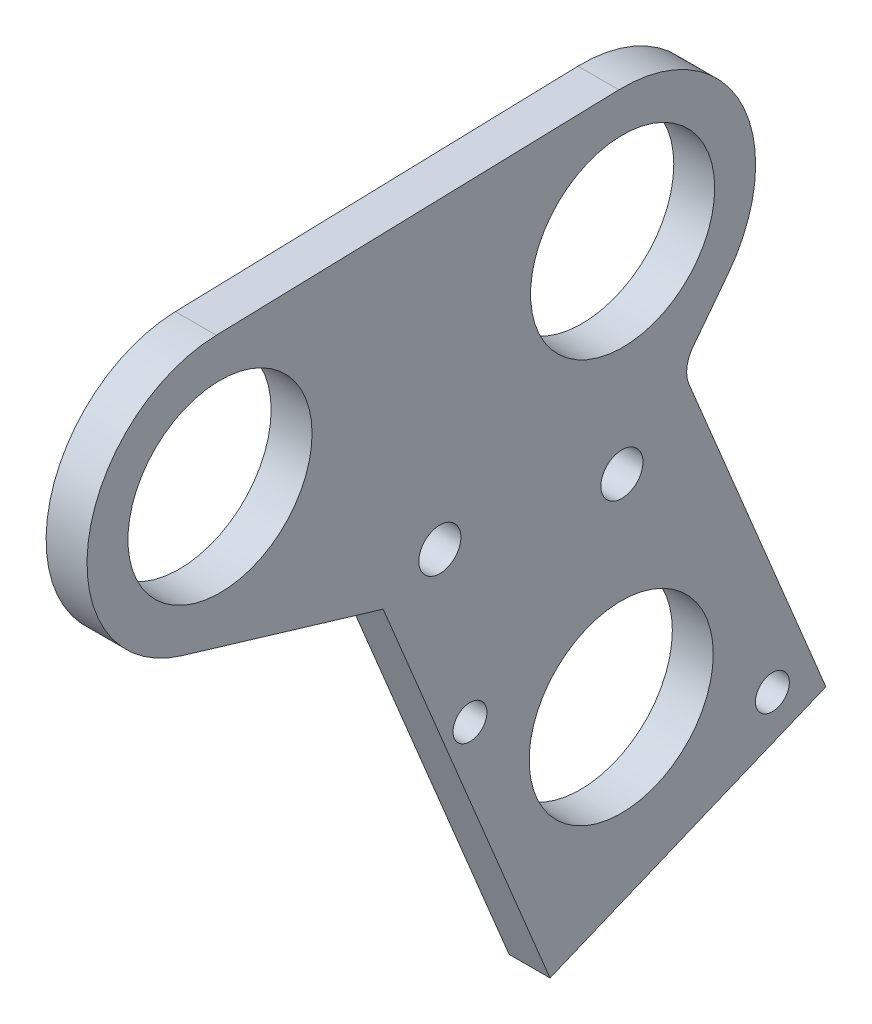
ISO-10303-21;
HEADER;
FILE_DESCRIPTION(('STEP AP214'),'2;1');
FILE_NAME('part.step','',(''),(''),'','','');
FILE_SCHEMA(('AUTOMOTIVE_DESIGN { 1 0 10303 214 1 1 1 1 }'));
ENDSEC;
DATA;
#1=APPLICATION_CONTEXT('core data for automotive mechanical design processes');
#2=APPLICATION_PROTOCOL_DEFINITION('international standard','automotive_design',2000,#1);
#3=PRODUCT_CONTEXT('',#1,'mechanical');
#4=PRODUCT('Part','Part','',(#3));
#5=PRODUCT_RELATED_PRODUCT_CATEGORY('part','',(#4));
#6=PRODUCT_DEFINITION_FORMATION('','',#4);
#7=PRODUCT_DEFINITION_CONTEXT('part definition',#1,'design');
#8=PRODUCT_DEFINITION('design','',#6,#7);
#9=PRODUCT_DEFINITION_SHAPE('','',#8);
#10=(LENGTH_UNIT() NAMED_UNIT(*) SI_UNIT(.MILLI.,.METRE.));
#11=(NAMED_UNIT(*) PLANE_ANGLE_UNIT() SI_UNIT($,.RADIAN.));
#12=(NAMED_UNIT(*) SI_UNIT($,.STERADIAN.) SOLID_ANGLE_UNIT());
#13=UNCERTAINTY_MEASURE_WITH_UNIT(LENGTH_MEASURE(1.E-05),#10,'distance_accuracy_value','');
#14=(GEOMETRIC_REPRESENTATION_CONTEXT(3) GLOBAL_UNCERTAINTY_ASSIGNED_CONTEXT((#13)) GLOBAL_UNIT_ASSIGNED_CONTEXT((#10,
#11,#12)) REPRESENTATION_CONTEXT('',''));
#15=CARTESIAN_POINT('',(0.,0.,0.));
#16=DIRECTION('',(0.,0.,1.));
#17=DIRECTION('',(1.,0.,0.));
#18=AXIS2_PLACEMENT_3D('',#15,#16,#17);
#19=CARTESIAN_POINT('',(6.35,178.280870815716,-272.869505506602));
#20=DIRECTION('',(1.,0.,0.));
#21=DIRECTION('',(0.,0.,-1.));
#22=AXIS2_PLACEMENT_3D('',#19,#20,#21);
#23=PLANE('',#22);
#24=CARTESIAN_POINT('',(6.35,151.048406008228,-244.504033835122));
#25=DIRECTION('',(1.,0.,0.));
#26=DIRECTION('',(0.,0.,-1.));
#27=AXIS2_PLACEMENT_3D('',#24,#25,#26);
#28=CIRCLE('',#27,3.26390000000001);
#29=CARTESIAN_POINT('',(6.35,151.048406008228,-247.767933835122));
#30=VERTEX_POINT('',#29);
#31=EDGE_CURVE('E271',#30,#30,#28,.T.);
#32=ORIENTED_EDGE('',*,*,#31,.F.);
#33=EDGE_LOOP('',(#32));
#34=FACE_BOUND('',#33,.T.);
#35=CARTESIAN_POINT('',(6.35,176.533582155287,-210.384530747088));
#36=DIRECTION('',(1.,0.,0.));
#37=DIRECTION('',(0.,0.,-1.));
#38=AXIS2_PLACEMENT_3D('',#35,#36,#37);
#39=CIRCLE('',#38,14.2875);
#40=CARTESIAN_POINT('',(6.35,176.533582155287,-224.672030747088));
#41=VERTEX_POINT('',#40);
#42=EDGE_CURVE('E255',#41,#41,#39,.T.);
#43=ORIENTED_EDGE('',*,*,#42,.F.);
#44=EDGE_LOOP('',(#43));
#45=FACE_BOUND('',#44,.T.);
#46=CARTESIAN_POINT('',(6.35,125.492031649383,-249.178886841428));
#47=DIRECTION('',(1.,0.,0.));
#48=DIRECTION('',(0.,0.,-1.));
#49=AXIS2_PLACEMENT_3D('',#46,#47,#48);
#50=CIRCLE('',#49,2.62890000000002);
#51=CARTESIAN_POINT('',(6.35,125.492031649383,-251.807786841428));
#52=VERTEX_POINT('',#51);
#53=EDGE_CURVE('E239',#52,#52,#50,.T.);
#54=ORIENTED_EDGE('',*,*,#53,.F.);
#55=EDGE_LOOP('',(#54));
#56=FACE_BOUND('',#55,.T.);
#57=DIRECTION('',(0.,0.923879533240872,0.382683430603715));
#58=VECTOR('',#57,1.);
#59=CARTESIAN_POINT('',(6.35,102.615117991688,-304.408641761252));
#60=LINE('',#59,#58);
#61=CARTESIAN_POINT('',(6.35,102.615117991688,-304.408641761252));
#62=VERTEX_POINT('',#61);
#63=CARTESIAN_POINT('',(6.35,153.891404032131,-283.169308769709));
#64=VERTEX_POINT('',#63);
#65=EDGE_CURVE('E121',#62,#64,#60,.T.);
#66=ORIENTED_EDGE('',*,*,#65,.T.);
#67=CARTESIAN_POINT('',(6.35,155.713933870382,-287.569285046769));
#68=DIRECTION('',(1.,0.,0.));
#69=DIRECTION('',(0.,0.,-1.));
#70=AXIS2_PLACEMENT_3D('',#67,#68,#69);
#71=CIRCLE('',#70,4.7625);
#72=CARTESIAN_POINT('',(6.35,158.613160183239,-283.790939769159));
#73=VERTEX_POINT('',#72);
#74=EDGE_CURVE('E11',#64,#73,#71,.F.);
#75=ORIENTED_EDGE('',*,*,#74,.T.);
#76=DIRECTION('',(0.,0.793353339130631,-0.608761430521249));
#77=VECTOR('',#76,1.);
#78=CARTESIAN_POINT('',(6.35,156.43173152012,-282.117070676989));
#79=LINE('',#78,#77);
#80=CARTESIAN_POINT('',(6.35,165.717556793334,-289.242335042911));
#81=VERTEX_POINT('',#80);
#82=EDGE_CURVE('E110',#73,#81,#79,.T.);
#83=ORIENTED_EDGE('',*,*,#82,.T.);
#84=CARTESIAN_POINT('',(6.35,178.280870815716,-272.869505506602));
#85=DIRECTION('',(1.,0.,0.));
#86=DIRECTION('',(0.,0.,-1.));
#87=AXIS2_PLACEMENT_3D('',#84,#85,#86);
#88=CIRCLE('',#87,20.6375);
#89=CARTESIAN_POINT('',(6.35,198.910306814134,-272.292637551869));
#90=VERTEX_POINT('',#89);
#91=EDGE_CURVE('E114',#81,#90,#88,.T.);
#92=ORIENTED_EDGE('',*,*,#91,.T.);
#93=DIRECTION('',(0.,-0.0279524145237204,0.999609254920288));
#94=VECTOR('',#93,1.);
#95=CARTESIAN_POINT('',(6.35,198.057364051982,-241.790461139146));
#96=LINE('',#95,#94);
#97=CARTESIAN_POINT('',(6.35,197.163018153705,-209.807662792355));
#98=VERTEX_POINT('',#97);
#99=EDGE_CURVE('E138',#90,#98,#96,.T.);
#100=ORIENTED_EDGE('',*,*,#99,.T.);
#101=CARTESIAN_POINT('',(6.35,176.533582155287,-210.384530747088));
#102=DIRECTION('',(1.,0.,0.));
#103=DIRECTION('',(0.,0.,-1.));
#104=AXIS2_PLACEMENT_3D('',#101,#102,#103);
#105=CIRCLE('',#104,20.6375);
#106=CARTESIAN_POINT('',(6.35,156.764386520821,-204.461245322917));
#107=VERTEX_POINT('',#106);
#108=EDGE_CURVE('E141',#98,#107,#105,.T.);
#109=ORIENTED_EDGE('',*,*,#108,.T.);
#110=DIRECTION('',(0.,-0.287015647446186,-0.957925893856642));
#111=VECTOR('',#110,1.);
#112=CARTESIAN_POINT('',(6.35,156.764386520821,-204.461245322917));
#113=LINE('',#112,#111);
#114=CARTESIAN_POINT('',(6.35,147.403346331728,-235.704081281002));
#115=VERTEX_POINT('',#114);
#116=EDGE_CURVE('E147',#107,#115,#113,.T.);
#117=ORIENTED_EDGE('',*,*,#116,.T.);
#118=DIRECTION('',(0.,-0.923879533240872,-0.382683430603714));
#119=VECTOR('',#118,1.);
#120=CARTESIAN_POINT('',(6.35,84.8834718986503,-261.600661049402));
#121=LINE('',#120,#119);
#122=CARTESIAN_POINT('',(6.35,84.8834718986503,-261.600661049402));
#123=VERTEX_POINT('',#122);
#124=EDGE_CURVE('E150',#115,#123,#121,.T.);
#125=ORIENTED_EDGE('',*,*,#124,.T.);
#126=DIRECTION('',(0.,0.382683430603714,-0.923879533240872));
#127=VECTOR('',#126,1.);
#128=CARTESIAN_POINT('',(6.35,84.8834718986503,-261.600661049402));
#129=LINE('',#128,#127);
#130=EDGE_CURVE('E153',#123,#62,#129,.T.);
#131=ORIENTED_EDGE('',*,*,#130,.T.);
#132=EDGE_LOOP('',(#66,#75,#83,#92,#100,#109,#117,#125,#131));
#133=FACE_BOUND('',#132,.T.);
#134=CARTESIAN_POINT('',(6.35,106.051713243434,-296.111966940839));
#135=DIRECTION('',(1.,0.,0.));
#136=DIRECTION('',(0.,0.,-1.));
#137=AXIS2_PLACEMENT_3D('',#134,#135,#136);
#138=CIRCLE('',#137,2.62889999999999);
#139=CARTESIAN_POINT('',(6.35,106.051713243434,-298.740866940839));
#140=VERTEX_POINT('',#139);
#141=EDGE_CURVE('E160',#140,#140,#138,.T.);
#142=ORIENTED_EDGE('',*,*,#141,.F.);
#143=EDGE_LOOP('',(#142));
#144=FACE_BOUND('',#143,.T.);
#145=CARTESIAN_POINT('',(6.35,115.771872446409,-272.645426891133));
#146=DIRECTION('',(1.,0.,0.));
#147=DIRECTION('',(0.,0.,-1.));
#148=AXIS2_PLACEMENT_3D('',#145,#146,#147);
#149=CIRCLE('',#148,14.2875);
#150=CARTESIAN_POINT('',(6.35,115.771872446409,-286.932926891133));
#151=VERTEX_POINT('',#150);
#152=EDGE_CURVE('E247',#151,#151,#149,.T.);
#153=ORIENTED_EDGE('',*,*,#152,.F.);
#154=EDGE_LOOP('',(#153));
#155=FACE_BOUND('',#154,.T.);
#156=CARTESIAN_POINT('',(6.35,178.280870815716,-272.869505506602));
#157=DIRECTION('',(1.,0.,0.));
#158=DIRECTION('',(0.,0.,-1.));
#159=AXIS2_PLACEMENT_3D('',#156,#157,#158);
#160=CIRCLE('',#159,14.2875);
#161=CARTESIAN_POINT('',(6.35,178.280870815716,-287.157005506602));
#162=VERTEX_POINT('',#161);
#163=EDGE_CURVE('E263',#162,#162,#160,.T.);
#164=ORIENTED_EDGE('',*,*,#163,.F.);
#165=EDGE_LOOP('',(#164));
#166=FACE_BOUND('',#165,.T.);
#167=CARTESIAN_POINT('',(6.35,147.026371631063,-272.757466198868));
#168=DIRECTION('',(1.,0.,0.));
#169=DIRECTION('',(0.,0.,-1.));
#170=AXIS2_PLACEMENT_3D('',#167,#168,#169);
#171=CIRCLE('',#170,3.26390000000001);
#172=CARTESIAN_POINT('',(6.35,147.026371631063,-276.021366198868));
#173=VERTEX_POINT('',#172);
#174=EDGE_CURVE('E279',#173,#173,#171,.T.);
#175=ORIENTED_EDGE('',*,*,#174,.F.);
#176=EDGE_LOOP('',(#175));
#177=FACE_BOUND('',#176,.T.);
#178=ADVANCED_FACE('F39',(#34,#45,#56,#133,#144,#155,#166,#177),#23,.T.);
#179=CARTESIAN_POINT('',(0.,178.280870815716,-272.869505506602));
#180=DIRECTION('',(1.,0.,0.));
#181=DIRECTION('',(0.,0.,-1.));
#182=AXIS2_PLACEMENT_3D('',#179,#180,#181);
#183=PLANE('',#182);
#184=DIRECTION('',(0.,0.923879533240872,0.382683430603715));
#185=VECTOR('',#184,1.);
#186=CARTESIAN_POINT('',(0.,102.615117991688,-304.408641761252));
#187=LINE('',#186,#185);
#188=CARTESIAN_POINT('',(0.,102.615117991688,-304.408641761252));
#189=VERTEX_POINT('',#188);
#190=CARTESIAN_POINT('',(0.,153.891404032131,-283.169308769709));
#191=VERTEX_POINT('',#190);
#192=EDGE_CURVE('E157',#189,#191,#187,.T.);
#193=ORIENTED_EDGE('',*,*,#192,.F.);
#194=DIRECTION('',(0.,0.382683430603714,-0.923879533240872));
#195=VECTOR('',#194,1.);
#196=CARTESIAN_POINT('',(0.,84.8834718986503,-261.600661049402));
#197=LINE('',#196,#195);
#198=CARTESIAN_POINT('',(0.,84.8834718986503,-261.600661049402));
#199=VERTEX_POINT('',#198);
#200=EDGE_CURVE('E178',#199,#189,#197,.T.);
#201=ORIENTED_EDGE('',*,*,#200,.F.);
#202=DIRECTION('',(0.,-0.923879533240872,-0.382683430603714));
#203=VECTOR('',#202,1.);
#204=CARTESIAN_POINT('',(0.,84.8834718986503,-261.600661049402));
#205=LINE('',#204,#203);
#206=CARTESIAN_POINT('',(0.,147.403346331728,-235.704081281002));
#207=VERTEX_POINT('',#206);
#208=EDGE_CURVE('E175',#207,#199,#205,.T.);
#209=ORIENTED_EDGE('',*,*,#208,.F.);
#210=DIRECTION('',(0.,-0.287015647446186,-0.957925893856642));
#211=VECTOR('',#210,1.);
#212=CARTESIAN_POINT('',(0.,156.764386520821,-204.461245322917));
#213=LINE('',#212,#211);
#214=CARTESIAN_POINT('',(0.,156.764386520821,-204.461245322917));
#215=VERTEX_POINT('',#214);
#216=EDGE_CURVE('E172',#215,#207,#213,.T.);
#217=ORIENTED_EDGE('',*,*,#216,.F.);
#218=CARTESIAN_POINT('',(0.,176.533582155287,-210.384530747088));
#219=DIRECTION('',(1.,0.,0.));
#220=DIRECTION('',(0.,0.,-1.));
#221=AXIS2_PLACEMENT_3D('',#218,#219,#220);
#222=CIRCLE('',#221,20.6375);
#223=CARTESIAN_POINT('',(0.,197.163018153705,-209.807662792355));
#224=VERTEX_POINT('',#223);
#225=EDGE_CURVE('E169',#224,#215,#222,.T.);
#226=ORIENTED_EDGE('',*,*,#225,.F.);
#227=DIRECTION('',(0.,-0.0279524145237189,0.999609254920288));
#228=VECTOR('',#227,1.);
#229=CARTESIAN_POINT('',(0.,198.057364051982,-241.790461139146));
#230=LINE('',#229,#228);
#231=CARTESIAN_POINT('',(0.,198.910306814134,-272.292637551869));
#232=VERTEX_POINT('',#231);
#233=EDGE_CURVE('E166',#232,#224,#230,.T.);
#234=ORIENTED_EDGE('',*,*,#233,.F.);
#235=CARTESIAN_POINT('',(0.,178.280870815716,-272.869505506602));
#236=DIRECTION('',(1.,0.,0.));
#237=DIRECTION('',(0.,0.,-1.));
#238=AXIS2_PLACEMENT_3D('',#235,#236,#237);
#239=CIRCLE('',#238,20.6375);
#240=CARTESIAN_POINT('',(0.,165.717556793334,-289.242335042911));
#241=VERTEX_POINT('',#240);
#242=EDGE_CURVE('E163',#241,#232,#239,.T.);
#243=ORIENTED_EDGE('',*,*,#242,.F.);
#244=DIRECTION('',(0.,0.793353339130631,-0.608761430521249));
#245=VECTOR('',#244,1.);
#246=CARTESIAN_POINT('',(0.,156.43173152012,-282.117070676989));
#247=LINE('',#246,#245);
#248=CARTESIAN_POINT('',(0.,158.613160183239,-283.790939769159));
#249=VERTEX_POINT('',#248);
#250=EDGE_CURVE('E126',#249,#241,#247,.T.);
#251=ORIENTED_EDGE('',*,*,#250,.F.);
#252=CARTESIAN_POINT('',(0.,155.713933870382,-287.569285046769));
#253=DIRECTION('',(1.,0.,0.));
#254=DIRECTION('',(0.,0.,-1.));
#255=AXIS2_PLACEMENT_3D('',#252,#253,#254);
#256=CIRCLE('',#255,4.7625);
#257=EDGE_CURVE('E48',#249,#191,#256,.T.);
#258=ORIENTED_EDGE('',*,*,#257,.T.);
#259=EDGE_LOOP('',(#193,#201,#209,#217,#226,#234,#243,#251,#258));
#260=FACE_BOUND('',#259,.T.);
#261=CARTESIAN_POINT('',(0.,106.051713243434,-296.111966940839));
#262=DIRECTION('',(1.,0.,0.));
#263=DIRECTION('',(0.,0.,-1.));
#264=AXIS2_PLACEMENT_3D('',#261,#262,#263);
#265=CIRCLE('',#264,2.62889999999999);
#266=CARTESIAN_POINT('',(0.,106.051713243434,-298.740866940839));
#267=VERTEX_POINT('',#266);
#268=EDGE_CURVE('E235',#267,#267,#265,.T.);
#269=ORIENTED_EDGE('',*,*,#268,.T.);
#270=EDGE_LOOP('',(#269));
#271=FACE_BOUND('',#270,.T.);
#272=CARTESIAN_POINT('',(0.,125.492031649383,-249.178886841428));
#273=DIRECTION('',(1.,0.,0.));
#274=DIRECTION('',(0.,0.,-1.));
#275=AXIS2_PLACEMENT_3D('',#272,#273,#274);
#276=CIRCLE('',#275,2.62890000000002);
#277=CARTESIAN_POINT('',(0.,125.492031649383,-251.807786841428));
#278=VERTEX_POINT('',#277);
#279=EDGE_CURVE('E243',#278,#278,#276,.T.);
#280=ORIENTED_EDGE('',*,*,#279,.T.);
#281=EDGE_LOOP('',(#280));
#282=FACE_BOUND('',#281,.T.);
#283=CARTESIAN_POINT('',(0.,115.771872446409,-272.645426891133));
#284=DIRECTION('',(1.,0.,0.));
#285=DIRECTION('',(0.,0.,-1.));
#286=AXIS2_PLACEMENT_3D('',#283,#284,#285);
#287=CIRCLE('',#286,14.2875);
#288=CARTESIAN_POINT('',(0.,115.771872446409,-286.932926891133));
#289=VERTEX_POINT('',#288);
#290=EDGE_CURVE('E251',#289,#289,#287,.T.);
#291=ORIENTED_EDGE('',*,*,#290,.T.);
#292=EDGE_LOOP('',(#291));
#293=FACE_BOUND('',#292,.T.);
#294=CARTESIAN_POINT('',(0.,176.533582155287,-210.384530747088));
#295=DIRECTION('',(1.,0.,0.));
#296=DIRECTION('',(0.,0.,-1.));
#297=AXIS2_PLACEMENT_3D('',#294,#295,#296);
#298=CIRCLE('',#297,14.2875);
#299=CARTESIAN_POINT('',(0.,176.533582155287,-224.672030747088));
#300=VERTEX_POINT('',#299);
#301=EDGE_CURVE('E259',#300,#300,#298,.T.);
#302=ORIENTED_EDGE('',*,*,#301,.T.);
#303=EDGE_LOOP('',(#302));
#304=FACE_BOUND('',#303,.T.);
#305=CARTESIAN_POINT('',(0.,178.280870815716,-272.869505506602));
#306=DIRECTION('',(1.,0.,0.));
#307=DIRECTION('',(0.,0.,-1.));
#308=AXIS2_PLACEMENT_3D('',#305,#306,#307);
#309=CIRCLE('',#308,14.2875);
#310=CARTESIAN_POINT('',(0.,178.280870815716,-287.157005506602));
#311=VERTEX_POINT('',#310);
#312=EDGE_CURVE('E267',#311,#311,#309,.T.);
#313=ORIENTED_EDGE('',*,*,#312,.T.);
#314=EDGE_LOOP('',(#313));
#315=FACE_BOUND('',#314,.T.);
#316=CARTESIAN_POINT('',(0.,151.048406008228,-244.504033835122));
#317=DIRECTION('',(1.,0.,0.));
#318=DIRECTION('',(0.,0.,-1.));
#319=AXIS2_PLACEMENT_3D('',#316,#317,#318);
#320=CIRCLE('',#319,3.26390000000001);
#321=CARTESIAN_POINT('',(0.,151.048406008228,-247.767933835122));
#322=VERTEX_POINT('',#321);
#323=EDGE_CURVE('E275',#322,#322,#320,.T.);
#324=ORIENTED_EDGE('',*,*,#323,.T.);
#325=EDGE_LOOP('',(#324));
#326=FACE_BOUND('',#325,.T.);
#327=CARTESIAN_POINT('',(0.,147.026371631063,-272.757466198868));
#328=DIRECTION('',(1.,0.,0.));
#329=DIRECTION('',(0.,0.,-1.));
#330=AXIS2_PLACEMENT_3D('',#327,#328,#329);
#331=CIRCLE('',#330,3.26390000000001);
#332=CARTESIAN_POINT('',(0.,147.026371631063,-276.021366198868));
#333=VERTEX_POINT('',#332);
#334=EDGE_CURVE('E283',#333,#333,#331,.T.);
#335=ORIENTED_EDGE('',*,*,#334,.T.);
#336=EDGE_LOOP('',(#335));
#337=FACE_BOUND('',#336,.T.);
#338=ADVANCED_FACE('F207',(#260,#271,#282,#293,#304,#315,#326,#337),#183,.F.);
#339=CARTESIAN_POINT('',(6.35,102.615117991688,-304.408641761252));
#340=DIRECTION('',(0.,-0.382683430603715,0.923879533240872));
#341=DIRECTION('',(0.,-0.923879533240872,-0.382683430603715));
#342=AXIS2_PLACEMENT_3D('',#339,#340,#341);
#343=PLANE('',#342);
#344=ORIENTED_EDGE('',*,*,#192,.T.);
#345=DIRECTION('',(-1.,0.,0.));
#346=VECTOR('',#345,1.);
#347=CARTESIAN_POINT('',(6.35,153.891404032131,-283.169308769709));
#348=LINE('',#347,#346);
#349=EDGE_CURVE('E55',#191,#64,#348,.F.);
#350=ORIENTED_EDGE('',*,*,#349,.T.);
#351=ORIENTED_EDGE('',*,*,#65,.F.);
#352=DIRECTION('',(-1.,0.,0.));
#353=VECTOR('',#352,1.);
#354=CARTESIAN_POINT('',(6.35,102.615117991688,-304.408641761252));
#355=LINE('',#354,#353);
#356=EDGE_CURVE('E156',#62,#189,#355,.T.);
#357=ORIENTED_EDGE('',*,*,#356,.T.);
#358=EDGE_LOOP('',(#344,#350,#351,#357));
#359=FACE_BOUND('',#358,.T.);
#360=ADVANCED_FACE('F232',(#359),#343,.F.);
#361=CARTESIAN_POINT('',(6.35,156.43173152012,-282.117070676989));
#362=DIRECTION('',(0.,0.608761430521249,0.793353339130631));
#363=DIRECTION('',(0.,-0.793353339130631,0.608761430521249));
#364=AXIS2_PLACEMENT_3D('',#361,#362,#363);
#365=PLANE('',#364);
#366=ORIENTED_EDGE('',*,*,#82,.F.);
#367=DIRECTION('',(-1.,0.,0.));
#368=VECTOR('',#367,1.);
#369=CARTESIAN_POINT('',(0.,158.613160183239,-283.790939769159));
#370=LINE('',#369,#368);
#371=EDGE_CURVE('E131',#73,#249,#370,.T.);
#372=ORIENTED_EDGE('',*,*,#371,.T.);
#373=ORIENTED_EDGE('',*,*,#250,.T.);
#374=DIRECTION('',(-1.,0.,0.));
#375=VECTOR('',#374,1.);
#376=CARTESIAN_POINT('',(6.35,165.717556793334,-289.242335042911));
#377=LINE('',#376,#375);
#378=EDGE_CURVE('E124',#81,#241,#377,.T.);
#379=ORIENTED_EDGE('',*,*,#378,.F.);
#380=EDGE_LOOP('',(#366,#372,#373,#379));
#381=FACE_BOUND('',#380,.T.);
#382=ADVANCED_FACE('F125',(#381),#365,.F.);
#383=CARTESIAN_POINT('',(6.35,178.280870815716,-272.869505506602));
#384=DIRECTION('',(-1.,0.,0.));
#385=DIRECTION('',(0.,0.,1.));
#386=AXIS2_PLACEMENT_3D('',#383,#384,#385);
#387=CYLINDRICAL_SURFACE('',#386,20.6375);
#388=ORIENTED_EDGE('',*,*,#242,.T.);
#389=DIRECTION('',(-1.,0.,0.));
#390=VECTOR('',#389,1.);
#391=CARTESIAN_POINT('',(6.35,198.910306814134,-272.292637551869));
#392=LINE('',#391,#390);
#393=EDGE_CURVE('E132',#90,#232,#392,.T.);
#394=ORIENTED_EDGE('',*,*,#393,.F.);
#395=ORIENTED_EDGE('',*,*,#91,.F.);
#396=ORIENTED_EDGE('',*,*,#378,.T.);
#397=EDGE_LOOP('',(#388,#394,#395,#396));
#398=FACE_BOUND('',#397,.T.);
#399=ADVANCED_FACE('F134',(#398),#387,.T.);
#400=CARTESIAN_POINT('',(6.35,198.057364051982,-241.790461139146));
#401=DIRECTION('',(0.,-0.999609254920288,-0.0279524145237189));
#402=DIRECTION('',(0.,0.0279524145237189,-0.999609254920289));
#403=AXIS2_PLACEMENT_3D('',#400,#401,#402);
#404=PLANE('',#403);
#405=ORIENTED_EDGE('',*,*,#233,.T.);
#406=DIRECTION('',(-1.,0.,0.));
#407=VECTOR('',#406,1.);
#408=CARTESIAN_POINT('',(6.35,197.163018153705,-209.807662792355));
#409=LINE('',#408,#407);
#410=EDGE_CURVE('E196',#98,#224,#409,.T.);
#411=ORIENTED_EDGE('',*,*,#410,.F.);
#412=ORIENTED_EDGE('',*,*,#99,.F.);
#413=ORIENTED_EDGE('',*,*,#393,.T.);
#414=EDGE_LOOP('',(#405,#411,#412,#413));
#415=FACE_BOUND('',#414,.T.);
#416=ADVANCED_FACE('F211',(#415),#404,.F.);
#417=CARTESIAN_POINT('',(6.35,176.533582155287,-210.384530747088));
#418=DIRECTION('',(-1.,0.,0.));
#419=DIRECTION('',(0.,0.,1.));
#420=AXIS2_PLACEMENT_3D('',#417,#418,#419);
#421=CYLINDRICAL_SURFACE('',#420,20.6375);
#422=ORIENTED_EDGE('',*,*,#225,.T.);
#423=DIRECTION('',(-1.,0.,0.));
#424=VECTOR('',#423,1.);
#425=CARTESIAN_POINT('',(6.35,156.764386520821,-204.461245322917));
#426=LINE('',#425,#424);
#427=EDGE_CURVE('E192',#107,#215,#426,.T.);
#428=ORIENTED_EDGE('',*,*,#427,.F.);
#429=ORIENTED_EDGE('',*,*,#108,.F.);
#430=ORIENTED_EDGE('',*,*,#410,.T.);
#431=EDGE_LOOP('',(#422,#428,#429,#430));
#432=FACE_BOUND('',#431,.T.);
#433=ADVANCED_FACE('F218',(#432),#421,.T.);
#434=CARTESIAN_POINT('',(6.35,156.764386520821,-204.461245322917));
#435=DIRECTION('',(0.,0.957925893856642,-0.287015647446186));
#436=DIRECTION('',(0.,0.287015647446186,0.957925893856642));
#437=AXIS2_PLACEMENT_3D('',#434,#435,#436);
#438=PLANE('',#437);
#439=ORIENTED_EDGE('',*,*,#216,.T.);
#440=DIRECTION('',(-1.,0.,0.));
#441=VECTOR('',#440,1.);
#442=CARTESIAN_POINT('',(6.35,147.403346331728,-235.704081281002));
#443=LINE('',#442,#441);
#444=EDGE_CURVE('E188',#115,#207,#443,.T.);
#445=ORIENTED_EDGE('',*,*,#444,.F.);
#446=ORIENTED_EDGE('',*,*,#116,.F.);
#447=ORIENTED_EDGE('',*,*,#427,.T.);
#448=EDGE_LOOP('',(#439,#445,#446,#447));
#449=FACE_BOUND('',#448,.T.);
#450=ADVANCED_FACE('F221',(#449),#438,.F.);
#451=CARTESIAN_POINT('',(6.35,84.8834718986503,-261.600661049402));
#452=DIRECTION('',(0.,0.382683430603714,-0.923879533240873));
#453=DIRECTION('',(0.,0.923879533240873,0.382683430603714));
#454=AXIS2_PLACEMENT_3D('',#451,#452,#453);
#455=PLANE('',#454);
#456=ORIENTED_EDGE('',*,*,#208,.T.);
#457=DIRECTION('',(-1.,0.,0.));
#458=VECTOR('',#457,1.);
#459=CARTESIAN_POINT('',(6.35,84.8834718986503,-261.600661049402));
#460=LINE('',#459,#458);
#461=EDGE_CURVE('E184',#123,#199,#460,.T.);
#462=ORIENTED_EDGE('',*,*,#461,.F.);
#463=ORIENTED_EDGE('',*,*,#124,.F.);
#464=ORIENTED_EDGE('',*,*,#444,.T.);
#465=EDGE_LOOP('',(#456,#462,#463,#464));
#466=FACE_BOUND('',#465,.T.);
#467=ADVANCED_FACE('F226',(#466),#455,.F.);
#468=CARTESIAN_POINT('',(6.35,84.8834718986503,-261.600661049402));
#469=DIRECTION('',(0.,0.923879533240872,0.382683430603714));
#470=DIRECTION('',(0.,-0.382683430603714,0.923879533240872));
#471=AXIS2_PLACEMENT_3D('',#468,#469,#470);
#472=PLANE('',#471);
#473=ORIENTED_EDGE('',*,*,#200,.T.);
#474=ORIENTED_EDGE('',*,*,#356,.F.);
#475=ORIENTED_EDGE('',*,*,#130,.F.);
#476=ORIENTED_EDGE('',*,*,#461,.T.);
#477=EDGE_LOOP('',(#473,#474,#475,#476));
#478=FACE_BOUND('',#477,.T.);
#479=ADVANCED_FACE('F230',(#478),#472,.F.);
#480=CARTESIAN_POINT('',(6.35,106.051713243434,-296.111966940839));
#481=DIRECTION('',(-1.,0.,0.));
#482=DIRECTION('',(0.,0.,1.));
#483=AXIS2_PLACEMENT_3D('',#480,#481,#482);
#484=CYLINDRICAL_SURFACE('',#483,2.62889999999999);
#485=ORIENTED_EDGE('',*,*,#141,.T.);
#486=EDGE_LOOP('',(#485));
#487=FACE_BOUND('',#486,.T.);
#488=ORIENTED_EDGE('',*,*,#268,.F.);
#489=EDGE_LOOP('',(#488));
#490=FACE_BOUND('',#489,.T.);
#491=ADVANCED_FACE('F304',(#487,#490),#484,.F.);
#492=CARTESIAN_POINT('',(6.35,125.492031649383,-249.178886841428));
#493=DIRECTION('',(-1.,0.,0.));
#494=DIRECTION('',(0.,0.,1.));
#495=AXIS2_PLACEMENT_3D('',#492,#493,#494);
#496=CYLINDRICAL_SURFACE('',#495,2.62890000000002);
#497=ORIENTED_EDGE('',*,*,#53,.T.);
#498=EDGE_LOOP('',(#497));
#499=FACE_BOUND('',#498,.T.);
#500=ORIENTED_EDGE('',*,*,#279,.F.);
#501=EDGE_LOOP('',(#500));
#502=FACE_BOUND('',#501,.T.);
#503=ADVANCED_FACE('F360',(#499,#502),#496,.F.);
#504=CARTESIAN_POINT('',(6.35,115.771872446409,-272.645426891133));
#505=DIRECTION('',(-1.,0.,0.));
#506=DIRECTION('',(0.,0.,1.));
#507=AXIS2_PLACEMENT_3D('',#504,#505,#506);
#508=CYLINDRICAL_SURFACE('',#507,14.2875);
#509=ORIENTED_EDGE('',*,*,#152,.T.);
#510=EDGE_LOOP('',(#509));
#511=FACE_BOUND('',#510,.T.);
#512=ORIENTED_EDGE('',*,*,#290,.F.);
#513=EDGE_LOOP('',(#512));
#514=FACE_BOUND('',#513,.T.);
#515=ADVANCED_FACE('F367',(#511,#514),#508,.F.);
#516=CARTESIAN_POINT('',(6.35,176.533582155287,-210.384530747088));
#517=DIRECTION('',(-1.,0.,0.));
#518=DIRECTION('',(0.,0.,1.));
#519=AXIS2_PLACEMENT_3D('',#516,#517,#518);
#520=CYLINDRICAL_SURFACE('',#519,14.2875);
#521=ORIENTED_EDGE('',*,*,#42,.T.);
#522=EDGE_LOOP('',(#521));
#523=FACE_BOUND('',#522,.T.);
#524=ORIENTED_EDGE('',*,*,#301,.F.);
#525=EDGE_LOOP('',(#524));
#526=FACE_BOUND('',#525,.T.);
#527=ADVANCED_FACE('F374',(#523,#526),#520,.F.);
#528=CARTESIAN_POINT('',(6.35,178.280870815716,-272.869505506602));
#529=DIRECTION('',(-1.,0.,0.));
#530=DIRECTION('',(0.,0.,1.));
#531=AXIS2_PLACEMENT_3D('',#528,#529,#530);
#532=CYLINDRICAL_SURFACE('',#531,14.2875);
#533=ORIENTED_EDGE('',*,*,#163,.T.);
#534=EDGE_LOOP('',(#533));
#535=FACE_BOUND('',#534,.T.);
#536=ORIENTED_EDGE('',*,*,#312,.F.);
#537=EDGE_LOOP('',(#536));
#538=FACE_BOUND('',#537,.T.);
#539=ADVANCED_FACE('F382',(#535,#538),#532,.F.);
#540=CARTESIAN_POINT('',(6.35,151.048406008228,-244.504033835122));
#541=DIRECTION('',(-1.,0.,0.));
#542=DIRECTION('',(0.,0.,1.));
#543=AXIS2_PLACEMENT_3D('',#540,#541,#542);
#544=CYLINDRICAL_SURFACE('',#543,3.26390000000001);
#545=ORIENTED_EDGE('',*,*,#31,.T.);
#546=EDGE_LOOP('',(#545));
#547=FACE_BOUND('',#546,.T.);
#548=ORIENTED_EDGE('',*,*,#323,.F.);
#549=EDGE_LOOP('',(#548));
#550=FACE_BOUND('',#549,.T.);
#551=ADVANCED_FACE('F390',(#547,#550),#544,.F.);
#552=CARTESIAN_POINT('',(6.35,147.026371631063,-272.757466198868));
#553=DIRECTION('',(-1.,0.,0.));
#554=DIRECTION('',(0.,0.,1.));
#555=AXIS2_PLACEMENT_3D('',#552,#553,#554);
#556=CYLINDRICAL_SURFACE('',#555,3.26390000000001);
#557=ORIENTED_EDGE('',*,*,#174,.T.);
#558=EDGE_LOOP('',(#557));
#559=FACE_BOUND('',#558,.T.);
#560=ORIENTED_EDGE('',*,*,#334,.F.);
#561=EDGE_LOOP('',(#560));
#562=FACE_BOUND('',#561,.T.);
#563=ADVANCED_FACE('F291',(#559,#562),#556,.F.);
#564=CARTESIAN_POINT('',(6.35,155.713933870382,-287.569285046769));
#565=DIRECTION('',(1.,0.,0.));
#566=DIRECTION('',(0.,0.,-1.));
#567=AXIS2_PLACEMENT_3D('',#564,#565,#566);
#568=CYLINDRICAL_SURFACE('',#567,4.7625);
#569=ORIENTED_EDGE('',*,*,#74,.F.);
#570=ORIENTED_EDGE('',*,*,#349,.F.);
#571=ORIENTED_EDGE('',*,*,#257,.F.);
#572=ORIENTED_EDGE('',*,*,#371,.F.);
#573=EDGE_LOOP('',(#569,#570,#571,#572));
#574=FACE_BOUND('',#573,.T.);
#575=ADVANCED_FACE('F41',(#574),#568,.F.);
#576=CLOSED_SHELL('',(#178,#338,#360,#382,#399,#416,#433,#450,#467,#479,#491,#503,#515,#527,
#539,#551,#563,#575));
#577=MANIFOLD_SOLID_BREP('B2',#576);
#578=ADVANCED_BREP_SHAPE_REPRESENTATION('',(#18,#577),#14);
#579=SHAPE_DEFINITION_REPRESENTATION(#9,#578);
ENDSEC;
END-ISO-10303-21;
